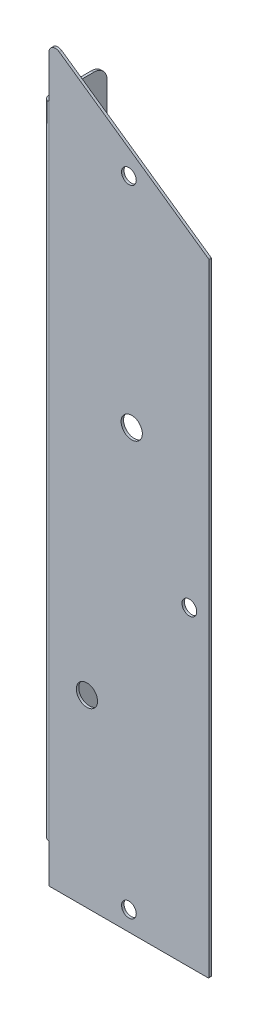
ISO-10303-21;
HEADER;
FILE_DESCRIPTION(('STEP AP214'),'2;1');
FILE_NAME('part.step','',(''),(''),'','','');
FILE_SCHEMA(('AUTOMOTIVE_DESIGN { 1 0 10303 214 1 1 1 1 }'));
ENDSEC;
DATA;
#1=APPLICATION_CONTEXT('core data for automotive mechanical design processes');
#2=APPLICATION_PROTOCOL_DEFINITION('international standard','automotive_design',2000,#1);
#3=PRODUCT_CONTEXT('',#1,'mechanical');
#4=PRODUCT('Part','Part','',(#3));
#5=PRODUCT_RELATED_PRODUCT_CATEGORY('part','',(#4));
#6=PRODUCT_DEFINITION_FORMATION('','',#4);
#7=PRODUCT_DEFINITION_CONTEXT('part definition',#1,'design');
#8=PRODUCT_DEFINITION('design','',#6,#7);
#9=PRODUCT_DEFINITION_SHAPE('','',#8);
#10=(LENGTH_UNIT() NAMED_UNIT(*) SI_UNIT(.MILLI.,.METRE.));
#11=(NAMED_UNIT(*) PLANE_ANGLE_UNIT() SI_UNIT($,.RADIAN.));
#12=(NAMED_UNIT(*) SI_UNIT($,.STERADIAN.) SOLID_ANGLE_UNIT());
#13=UNCERTAINTY_MEASURE_WITH_UNIT(LENGTH_MEASURE(1.E-05),#10,'distance_accuracy_value','');
#14=(GEOMETRIC_REPRESENTATION_CONTEXT(3) GLOBAL_UNCERTAINTY_ASSIGNED_CONTEXT((#13)) GLOBAL_UNIT_ASSIGNED_CONTEXT((#10,
#11,#12)) REPRESENTATION_CONTEXT('',''));
#15=CARTESIAN_POINT('',(0.,0.,0.));
#16=DIRECTION('',(0.,0.,1.));
#17=DIRECTION('',(1.,0.,0.));
#18=AXIS2_PLACEMENT_3D('',#15,#16,#17);
#19=CARTESIAN_POINT('',(-38.89375,-151.360053060756,-1.1938));
#20=DIRECTION('',(-1.,0.,0.));
#21=DIRECTION('',(0.,0.,1.));
#22=AXIS2_PLACEMENT_3D('',#19,#20,#21);
#23=PLANE('',#22);
#24=DIRECTION('',(0.,-1.,0.));
#25=VECTOR('',#24,1.);
#26=CARTESIAN_POINT('',(-38.89375,151.360053060756,-1.1938));
#27=LINE('',#26,#25);
#28=CARTESIAN_POINT('',(-38.89375,199.72832868611,-1.1938));
#29=VERTEX_POINT('',#28);
#30=CARTESIAN_POINT('',(-38.89375,179.236821939244,-1.1938));
#31=VERTEX_POINT('',#30);
#32=EDGE_CURVE('E232',#29,#31,#27,.T.);
#33=ORIENTED_EDGE('',*,*,#32,.T.);
#34=DIRECTION('',(0.,0.,-1.));
#35=VECTOR('',#34,1.);
#36=CARTESIAN_POINT('',(-38.89375,179.236821939244,0.));
#37=LINE('',#36,#35);
#38=CARTESIAN_POINT('',(-38.89375,179.236821939244,0.));
#39=VERTEX_POINT('',#38);
#40=EDGE_CURVE('E328',#31,#39,#37,.F.);
#41=ORIENTED_EDGE('',*,*,#40,.T.);
#42=DIRECTION('',(0.,-1.,0.));
#43=VECTOR('',#42,1.);
#44=CARTESIAN_POINT('',(-38.89375,-151.360053060756,0.));
#45=LINE('',#44,#43);
#46=CARTESIAN_POINT('',(-38.89375,199.72832868611,0.));
#47=VERTEX_POINT('',#46);
#48=EDGE_CURVE('E245',#47,#39,#45,.T.);
#49=ORIENTED_EDGE('',*,*,#48,.F.);
#50=DIRECTION('',(0.,0.,1.));
#51=VECTOR('',#50,1.);
#52=CARTESIAN_POINT('',(-38.89375,199.72832868611,-1.1938));
#53=LINE('',#52,#51);
#54=EDGE_CURVE('E261',#47,#29,#53,.F.);
#55=ORIENTED_EDGE('',*,*,#54,.T.);
#56=EDGE_LOOP('',(#33,#41,#49,#55));
#57=FACE_BOUND('',#56,.T.);
#58=ADVANCED_FACE('F47',(#57),#23,.T.);
#59=CARTESIAN_POINT('',(-38.89375,205.827446939244,-1.1938));
#60=DIRECTION('',(0.573576436351047,0.819152044288991,0.));
#61=DIRECTION('',(-0.819152044288991,0.573576436351047,0.));
#62=AXIS2_PLACEMENT_3D('',#59,#60,#61);
#63=PLANE('',#62);
#64=DIRECTION('',(-0.819152044288991,0.573576436351047,0.));
#65=VECTOR('',#64,1.);
#66=CARTESIAN_POINT('',(-38.89375,205.827446939244,0.));
#67=LINE('',#66,#65);
#68=CARTESIAN_POINT('',(38.7245131481768,151.478553980145,0.));
#69=VERTEX_POINT('',#68);
#70=CARTESIAN_POINT('',(-33.8976448145854,202.329136426728,0.));
#71=VERTEX_POINT('',#70);
#72=EDGE_CURVE('E214',#69,#71,#67,.T.);
#73=ORIENTED_EDGE('',*,*,#72,.F.);
#74=DIRECTION('',(0.,0.,1.));
#75=VECTOR('',#74,1.);
#76=CARTESIAN_POINT('',(38.7245131481768,151.478553980145,-1.1938));
#77=LINE('',#76,#75);
#78=CARTESIAN_POINT('',(38.7245131481768,151.478553980145,-1.1938));
#79=VERTEX_POINT('',#78);
#80=EDGE_CURVE('E325',#69,#79,#77,.F.);
#81=ORIENTED_EDGE('',*,*,#80,.T.);
#82=DIRECTION('',(-0.819152044288991,0.573576436351047,0.));
#83=VECTOR('',#82,1.);
#84=CARTESIAN_POINT('',(-38.89375,205.827446939244,-1.1938));
#85=LINE('',#84,#83);
#86=CARTESIAN_POINT('',(-33.8976448145854,202.329136426728,-1.1938));
#87=VERTEX_POINT('',#86);
#88=EDGE_CURVE('E227',#79,#87,#85,.T.);
#89=ORIENTED_EDGE('',*,*,#88,.T.);
#90=DIRECTION('',(0.,0.,1.));
#91=VECTOR('',#90,1.);
#92=CARTESIAN_POINT('',(-33.8976448145854,202.329136426728,-1.1938));
#93=LINE('',#92,#91);
#94=EDGE_CURVE('E243',#87,#71,#93,.T.);
#95=ORIENTED_EDGE('',*,*,#94,.T.);
#96=EDGE_LOOP('',(#73,#81,#89,#95));
#97=FACE_BOUND('',#96,.T.);
#98=ADVANCED_FACE('F391',(#97),#63,.T.);
#99=CARTESIAN_POINT('',(38.89375,-151.360053060756,-1.1938));
#100=DIRECTION('',(1.,0.,0.));
#101=DIRECTION('',(0.,0.,-1.));
#102=AXIS2_PLACEMENT_3D('',#99,#100,#101);
#103=PLANE('',#102);
#104=DIRECTION('',(0.,1.,0.));
#105=VECTOR('',#104,1.);
#106=CARTESIAN_POINT('',(38.89375,-151.360053060756,0.));
#107=LINE('',#106,#105);
#108=CARTESIAN_POINT('',(38.89375,-150.963178060756,0.));
#109=VERTEX_POINT('',#108);
#110=CARTESIAN_POINT('',(38.89375,151.153453012568,0.));
#111=VERTEX_POINT('',#110);
#112=EDGE_CURVE('E231',#109,#111,#107,.T.);
#113=ORIENTED_EDGE('',*,*,#112,.F.);
#114=DIRECTION('',(0.,0.,1.));
#115=VECTOR('',#114,1.);
#116=CARTESIAN_POINT('',(38.89375,-150.963178060756,-1.1938));
#117=LINE('',#116,#115);
#118=CARTESIAN_POINT('',(38.89375,-150.963178060756,-1.1938));
#119=VERTEX_POINT('',#118);
#120=EDGE_CURVE('E313',#109,#119,#117,.F.);
#121=ORIENTED_EDGE('',*,*,#120,.T.);
#122=DIRECTION('',(0.,1.,0.));
#123=VECTOR('',#122,1.);
#124=CARTESIAN_POINT('',(38.89375,-151.360053060756,-1.1938));
#125=LINE('',#124,#123);
#126=CARTESIAN_POINT('',(38.89375,151.153453012568,-1.1938));
#127=VERTEX_POINT('',#126);
#128=EDGE_CURVE('E240',#119,#127,#125,.T.);
#129=ORIENTED_EDGE('',*,*,#128,.T.);
#130=DIRECTION('',(0.,0.,1.));
#131=VECTOR('',#130,1.);
#132=CARTESIAN_POINT('',(38.89375,151.153453012568,-1.1938));
#133=LINE('',#132,#131);
#134=EDGE_CURVE('E309',#127,#111,#133,.T.);
#135=ORIENTED_EDGE('',*,*,#134,.T.);
#136=EDGE_LOOP('',(#113,#121,#129,#135));
#137=FACE_BOUND('',#136,.T.);
#138=ADVANCED_FACE('F399',(#137),#103,.T.);
#139=CARTESIAN_POINT('',(-38.89375,-151.360053060756,-1.1938));
#140=DIRECTION('',(0.,-1.,0.));
#141=DIRECTION('',(0.,0.,-1.));
#142=AXIS2_PLACEMENT_3D('',#139,#140,#141);
#143=PLANE('',#142);
#144=DIRECTION('',(1.,0.,0.));
#145=VECTOR('',#144,1.);
#146=CARTESIAN_POINT('',(-38.89375,-151.360053060756,-1.1938));
#147=LINE('',#146,#145);
#148=CARTESIAN_POINT('',(-38.496875,-151.360053060756,-1.1938));
#149=VERTEX_POINT('',#148);
#150=CARTESIAN_POINT('',(38.496875,-151.360053060756,-1.1938));
#151=VERTEX_POINT('',#150);
#152=EDGE_CURVE('E236',#149,#151,#147,.T.);
#153=ORIENTED_EDGE('',*,*,#152,.T.);
#154=DIRECTION('',(0.,0.,1.));
#155=VECTOR('',#154,1.);
#156=CARTESIAN_POINT('',(38.496875,-151.360053060756,-1.1938));
#157=LINE('',#156,#155);
#158=CARTESIAN_POINT('',(38.496875,-151.360053060756,0.));
#159=VERTEX_POINT('',#158);
#160=EDGE_CURVE('E296',#151,#159,#157,.T.);
#161=ORIENTED_EDGE('',*,*,#160,.T.);
#162=DIRECTION('',(1.,0.,0.));
#163=VECTOR('',#162,1.);
#164=CARTESIAN_POINT('',(-38.89375,-151.360053060756,0.));
#165=LINE('',#164,#163);
#166=CARTESIAN_POINT('',(-38.496875,-151.360053060756,0.));
#167=VERTEX_POINT('',#166);
#168=EDGE_CURVE('E248',#167,#159,#165,.T.);
#169=ORIENTED_EDGE('',*,*,#168,.F.);
#170=DIRECTION('',(0.,0.,1.));
#171=VECTOR('',#170,1.);
#172=CARTESIAN_POINT('',(-38.496875,-151.360053060756,-1.1938));
#173=LINE('',#172,#171);
#174=EDGE_CURVE('E293',#167,#149,#173,.F.);
#175=ORIENTED_EDGE('',*,*,#174,.T.);
#176=EDGE_LOOP('',(#153,#161,#169,#175));
#177=FACE_BOUND('',#176,.T.);
#178=ADVANCED_FACE('F404',(#177),#143,.T.);
#179=CARTESIAN_POINT('',(-38.89375,-132.706928060756,0.));
#180=VERTEX_POINT('',#179);
#181=CARTESIAN_POINT('',(-38.89375,-150.963178060756,0.));
#182=VERTEX_POINT('',#181);
#183=EDGE_CURVE('E220',#180,#182,#45,.T.);
#184=ORIENTED_EDGE('',*,*,#183,.F.);
#185=DIRECTION('',(0.,0.,-1.));
#186=VECTOR('',#185,1.);
#187=CARTESIAN_POINT('',(-38.89375,-132.706928060756,-1.1938));
#188=LINE('',#187,#186);
#189=CARTESIAN_POINT('',(-38.89375,-132.706928060756,-1.1938));
#190=VERTEX_POINT('',#189);
#191=EDGE_CURVE('E341',#180,#190,#188,.T.);
#192=ORIENTED_EDGE('',*,*,#191,.T.);
#193=CARTESIAN_POINT('',(-38.89375,-150.963178060756,-1.1938));
#194=VERTEX_POINT('',#193);
#195=EDGE_CURVE('E230',#190,#194,#27,.T.);
#196=ORIENTED_EDGE('',*,*,#195,.T.);
#197=DIRECTION('',(0.,0.,1.));
#198=VECTOR('',#197,1.);
#199=CARTESIAN_POINT('',(-38.89375,-150.963178060756,-1.1938));
#200=LINE('',#199,#198);
#201=EDGE_CURVE('E337',#194,#182,#200,.T.);
#202=ORIENTED_EDGE('',*,*,#201,.T.);
#203=EDGE_LOOP('',(#184,#192,#196,#202));
#204=FACE_BOUND('',#203,.T.);
#205=ADVANCED_FACE('F394',(#204),#23,.T.);
#206=CARTESIAN_POINT('',(0.,0.,-1.1938));
#207=DIRECTION('',(0.,0.,1.));
#208=DIRECTION('',(1.,0.,0.));
#209=AXIS2_PLACEMENT_3D('',#206,#207,#208);
#210=PLANE('',#209);
#211=CARTESIAN_POINT('',(1.36382604082695,61.7536011623218,-1.1938));
#212=DIRECTION('',(0.,0.,1.));
#213=DIRECTION('',(1.,0.,0.));
#214=AXIS2_PLACEMENT_3D('',#211,#212,#213);
#215=CIRCLE('',#214,5.159375);
#216=CARTESIAN_POINT('',(6.52320104082695,61.7536011623218,-1.1938));
#217=VERTEX_POINT('',#216);
#218=EDGE_CURVE('E822',#217,#217,#215,.T.);
#219=ORIENTED_EDGE('',*,*,#218,.T.);
#220=EDGE_LOOP('',(#219));
#221=FACE_BOUND('',#220,.T.);
#222=CARTESIAN_POINT('',(-20.413826040827,-61.7536011623218,-1.1938));
#223=DIRECTION('',(0.,0.,1.));
#224=DIRECTION('',(1.,0.,0.));
#225=AXIS2_PLACEMENT_3D('',#222,#223,#224);
#226=CIRCLE('',#225,5.159375);
#227=CARTESIAN_POINT('',(-15.254451040827,-61.7536011623218,-1.1938));
#228=VERTEX_POINT('',#227);
#229=EDGE_CURVE('E830',#228,#228,#226,.T.);
#230=ORIENTED_EDGE('',*,*,#229,.T.);
#231=EDGE_LOOP('',(#230));
#232=FACE_BOUND('',#231,.T.);
#233=CARTESIAN_POINT('',(29.36875,0.,-1.1938));
#234=DIRECTION('',(0.,0.,1.));
#235=DIRECTION('',(1.,0.,0.));
#236=AXIS2_PLACEMENT_3D('',#233,#234,#235);
#237=CIRCLE('',#236,3.571875);
#238=CARTESIAN_POINT('',(32.940625,0.,-1.1938));
#239=VERTEX_POINT('',#238);
#240=EDGE_CURVE('E434',#239,#239,#237,.F.);
#241=ORIENTED_EDGE('',*,*,#240,.F.);
#242=EDGE_LOOP('',(#241));
#243=FACE_BOUND('',#242,.T.);
#244=CARTESIAN_POINT('',(0.,-141.835053060756,-1.1938));
#245=DIRECTION('',(0.,0.,1.));
#246=DIRECTION('',(1.,0.,0.));
#247=AXIS2_PLACEMENT_3D('',#244,#245,#246);
#248=CIRCLE('',#247,3.57187500000001);
#249=CARTESIAN_POINT('',(3.57187500000001,-141.835053060756,-1.1938));
#250=VERTEX_POINT('',#249);
#251=EDGE_CURVE('E833',#250,#250,#248,.F.);
#252=ORIENTED_EDGE('',*,*,#251,.F.);
#253=EDGE_LOOP('',(#252));
#254=FACE_BOUND('',#253,.T.);
#255=CARTESIAN_POINT('',(0.,166.965872042047,-1.1938));
#256=DIRECTION('',(0.,0.,1.));
#257=DIRECTION('',(1.,0.,0.));
#258=AXIS2_PLACEMENT_3D('',#255,#256,#257);
#259=CIRCLE('',#258,3.57187500000001);
#260=CARTESIAN_POINT('',(3.57187500000001,166.965872042047,-1.1938));
#261=VERTEX_POINT('',#260);
#262=EDGE_CURVE('E821',#261,#261,#259,.F.);
#263=ORIENTED_EDGE('',*,*,#262,.F.);
#264=EDGE_LOOP('',(#263));
#265=FACE_BOUND('',#264,.T.);
#266=ORIENTED_EDGE('',*,*,#128,.F.);
#267=CARTESIAN_POINT('',(38.496875,-150.963178060756,-1.1938));
#268=DIRECTION('',(0.,0.,1.));
#269=DIRECTION('',(1.,0.,0.));
#270=AXIS2_PLACEMENT_3D('',#267,#268,#269);
#271=CIRCLE('',#270,0.396875);
#272=EDGE_CURVE('E322',#119,#151,#271,.F.);
#273=ORIENTED_EDGE('',*,*,#272,.T.);
#274=ORIENTED_EDGE('',*,*,#152,.F.);
#275=CARTESIAN_POINT('',(-38.496875,-150.963178060756,-1.1938));
#276=DIRECTION('',(0.,0.,1.));
#277=DIRECTION('',(1.,0.,0.));
#278=AXIS2_PLACEMENT_3D('',#275,#276,#277);
#279=CIRCLE('',#278,0.396875);
#280=EDGE_CURVE('E316',#149,#194,#279,.F.);
#281=ORIENTED_EDGE('',*,*,#280,.T.);
#282=ORIENTED_EDGE('',*,*,#195,.F.);
#283=DIRECTION('',(0.,1.,0.));
#284=VECTOR('',#283,1.);
#285=CARTESIAN_POINT('',(-38.89375,-1937.29755306076,-1.1938));
#286=LINE('',#285,#284);
#287=EDGE_CURVE('E426',#190,#31,#286,.T.);
#288=ORIENTED_EDGE('',*,*,#287,.T.);
#289=ORIENTED_EDGE('',*,*,#32,.F.);
#290=CARTESIAN_POINT('',(-35.71875,199.72832868611,-1.1938));
#291=DIRECTION('',(0.,0.,1.));
#292=DIRECTION('',(1.,0.,0.));
#293=AXIS2_PLACEMENT_3D('',#290,#291,#292);
#294=CIRCLE('',#293,3.175);
#295=EDGE_CURVE('E264',#29,#87,#294,.F.);
#296=ORIENTED_EDGE('',*,*,#295,.T.);
#297=ORIENTED_EDGE('',*,*,#88,.F.);
#298=CARTESIAN_POINT('',(38.496875,151.153453012568,-1.1938));
#299=DIRECTION('',(0.,0.,1.));
#300=DIRECTION('',(1.,0.,0.));
#301=AXIS2_PLACEMENT_3D('',#298,#299,#300);
#302=CIRCLE('',#301,0.396875);
#303=EDGE_CURVE('E319',#79,#127,#302,.F.);
#304=ORIENTED_EDGE('',*,*,#303,.T.);
#305=EDGE_LOOP('',(#266,#273,#274,#281,#282,#288,#289,#296,#297,#304));
#306=FACE_BOUND('',#305,.T.);
#307=ADVANCED_FACE('F403',(#221,#232,#243,#254,#265,#306),#210,.F.);
#308=CARTESIAN_POINT('',(0.,0.,0.));
#309=DIRECTION('',(0.,0.,1.));
#310=DIRECTION('',(1.,0.,0.));
#311=AXIS2_PLACEMENT_3D('',#308,#309,#310);
#312=PLANE('',#311);
#313=CARTESIAN_POINT('',(1.36382604082695,61.7536011623218,0.));
#314=DIRECTION('',(0.,0.,1.));
#315=DIRECTION('',(1.,0.,0.));
#316=AXIS2_PLACEMENT_3D('',#313,#314,#315);
#317=CIRCLE('',#316,5.159375);
#318=CARTESIAN_POINT('',(6.52320104082695,61.7536011623218,0.));
#319=VERTEX_POINT('',#318);
#320=EDGE_CURVE('E804',#319,#319,#317,.T.);
#321=ORIENTED_EDGE('',*,*,#320,.F.);
#322=EDGE_LOOP('',(#321));
#323=FACE_BOUND('',#322,.T.);
#324=CARTESIAN_POINT('',(-20.413826040827,-61.7536011623218,0.));
#325=DIRECTION('',(0.,0.,1.));
#326=DIRECTION('',(1.,0.,0.));
#327=AXIS2_PLACEMENT_3D('',#324,#325,#326);
#328=CIRCLE('',#327,5.159375);
#329=CARTESIAN_POINT('',(-15.254451040827,-61.7536011623218,0.));
#330=VERTEX_POINT('',#329);
#331=EDGE_CURVE('E808',#330,#330,#328,.T.);
#332=ORIENTED_EDGE('',*,*,#331,.F.);
#333=EDGE_LOOP('',(#332));
#334=FACE_BOUND('',#333,.T.);
#335=CARTESIAN_POINT('',(29.36875,0.,0.));
#336=DIRECTION('',(0.,0.,1.));
#337=DIRECTION('',(1.,0.,0.));
#338=AXIS2_PLACEMENT_3D('',#335,#336,#337);
#339=CIRCLE('',#338,3.571875);
#340=CARTESIAN_POINT('',(32.940625,0.,0.));
#341=VERTEX_POINT('',#340);
#342=EDGE_CURVE('E812',#341,#341,#339,.T.);
#343=ORIENTED_EDGE('',*,*,#342,.F.);
#344=EDGE_LOOP('',(#343));
#345=FACE_BOUND('',#344,.T.);
#346=CARTESIAN_POINT('',(0.,-141.835053060756,0.));
#347=DIRECTION('',(0.,0.,1.));
#348=DIRECTION('',(1.,0.,0.));
#349=AXIS2_PLACEMENT_3D('',#346,#347,#348);
#350=CIRCLE('',#349,3.57187500000001);
#351=CARTESIAN_POINT('',(3.57187500000001,-141.835053060756,0.));
#352=VERTEX_POINT('',#351);
#353=EDGE_CURVE('E816',#352,#352,#350,.T.);
#354=ORIENTED_EDGE('',*,*,#353,.F.);
#355=EDGE_LOOP('',(#354));
#356=FACE_BOUND('',#355,.T.);
#357=CARTESIAN_POINT('',(0.,166.965872042047,0.));
#358=DIRECTION('',(0.,0.,1.));
#359=DIRECTION('',(1.,0.,0.));
#360=AXIS2_PLACEMENT_3D('',#357,#358,#359);
#361=CIRCLE('',#360,3.57187500000001);
#362=CARTESIAN_POINT('',(3.57187500000001,166.965872042047,0.));
#363=VERTEX_POINT('',#362);
#364=EDGE_CURVE('E819',#363,#363,#361,.T.);
#365=ORIENTED_EDGE('',*,*,#364,.F.);
#366=EDGE_LOOP('',(#365));
#367=FACE_BOUND('',#366,.T.);
#368=ORIENTED_EDGE('',*,*,#168,.T.);
#369=CARTESIAN_POINT('',(38.496875,-150.963178060756,0.));
#370=DIRECTION('',(0.,0.,1.));
#371=DIRECTION('',(1.,0.,0.));
#372=AXIS2_PLACEMENT_3D('',#369,#370,#371);
#373=CIRCLE('',#372,0.396875);
#374=EDGE_CURVE('E306',#159,#109,#373,.T.);
#375=ORIENTED_EDGE('',*,*,#374,.T.);
#376=ORIENTED_EDGE('',*,*,#112,.T.);
#377=CARTESIAN_POINT('',(38.496875,151.153453012568,0.));
#378=DIRECTION('',(0.,0.,1.));
#379=DIRECTION('',(1.,0.,0.));
#380=AXIS2_PLACEMENT_3D('',#377,#378,#379);
#381=CIRCLE('',#380,0.396875);
#382=EDGE_CURVE('E303',#111,#69,#381,.T.);
#383=ORIENTED_EDGE('',*,*,#382,.T.);
#384=ORIENTED_EDGE('',*,*,#72,.T.);
#385=CARTESIAN_POINT('',(-35.71875,199.72832868611,0.));
#386=DIRECTION('',(0.,0.,1.));
#387=DIRECTION('',(1.,0.,0.));
#388=AXIS2_PLACEMENT_3D('',#385,#386,#387);
#389=CIRCLE('',#388,3.175);
#390=EDGE_CURVE('E258',#71,#47,#389,.T.);
#391=ORIENTED_EDGE('',*,*,#390,.T.);
#392=ORIENTED_EDGE('',*,*,#48,.T.);
#393=DIRECTION('',(0.,1.,0.));
#394=VECTOR('',#393,1.);
#395=CARTESIAN_POINT('',(-38.89375,-1937.29755306076,0.));
#396=LINE('',#395,#394);
#397=EDGE_CURVE('E69',#180,#39,#396,.T.);
#398=ORIENTED_EDGE('',*,*,#397,.F.);
#399=ORIENTED_EDGE('',*,*,#183,.T.);
#400=CARTESIAN_POINT('',(-38.496875,-150.963178060756,0.));
#401=DIRECTION('',(0.,0.,1.));
#402=DIRECTION('',(1.,0.,0.));
#403=AXIS2_PLACEMENT_3D('',#400,#401,#402);
#404=CIRCLE('',#403,0.396875);
#405=EDGE_CURVE('E300',#182,#167,#404,.T.);
#406=ORIENTED_EDGE('',*,*,#405,.T.);
#407=EDGE_LOOP('',(#368,#375,#376,#383,#384,#391,#392,#398,#399,#406));
#408=FACE_BOUND('',#407,.T.);
#409=ADVANCED_FACE('F409',(#323,#334,#345,#356,#367,#408),#312,.T.);
#410=CARTESIAN_POINT('',(-40.39235,-151.360053060756,-29.7688));
#411=DIRECTION('',(0.,0.,1.));
#412=DIRECTION('',(0.,1.,0.));
#413=AXIS2_PLACEMENT_3D('',#410,#411,#412);
#414=PLANE('',#413);
#415=DIRECTION('',(0.,1.,0.));
#416=VECTOR('',#415,1.);
#417=CARTESIAN_POINT('',(-40.39235,-151.360053060756,-29.7688));
#418=LINE('',#417,#416);
#419=CARTESIAN_POINT('',(-40.39235,-125.960053060756,-29.7688));
#420=VERTEX_POINT('',#419);
#421=CARTESIAN_POINT('',(-40.39235,172.489946939244,-29.7688));
#422=VERTEX_POINT('',#421);
#423=EDGE_CURVE('E443',#420,#422,#418,.T.);
#424=ORIENTED_EDGE('',*,*,#423,.F.);
#425=DIRECTION('',(-1.,0.,0.));
#426=VECTOR('',#425,1.);
#427=CARTESIAN_POINT('',(-40.39235,-125.960053060756,-29.7688));
#428=LINE('',#427,#426);
#429=CARTESIAN_POINT('',(-41.58615,-125.960053060756,-29.7688));
#430=VERTEX_POINT('',#429);
#431=EDGE_CURVE('E271',#420,#430,#428,.T.);
#432=ORIENTED_EDGE('',*,*,#431,.T.);
#433=DIRECTION('',(0.,1.,0.));
#434=VECTOR('',#433,1.);
#435=CARTESIAN_POINT('',(-41.58615,-151.360053060756,-29.7688));
#436=LINE('',#435,#434);
#437=CARTESIAN_POINT('',(-41.58615,172.489946939244,-29.7688));
#438=VERTEX_POINT('',#437);
#439=EDGE_CURVE('E197',#430,#438,#436,.T.);
#440=ORIENTED_EDGE('',*,*,#439,.T.);
#441=DIRECTION('',(-1.,0.,0.));
#442=VECTOR('',#441,1.);
#443=CARTESIAN_POINT('',(-40.39235,172.489946939244,-29.7688));
#444=LINE('',#443,#442);
#445=EDGE_CURVE('E268',#438,#422,#444,.F.);
#446=ORIENTED_EDGE('',*,*,#445,.T.);
#447=EDGE_LOOP('',(#424,#432,#440,#446));
#448=FACE_BOUND('',#447,.T.);
#449=ADVANCED_FACE('F466',(#448),#414,.F.);
#450=CARTESIAN_POINT('',(-40.39235,-132.310053060756,-29.7688));
#451=DIRECTION('',(0.,-1.,0.));
#452=DIRECTION('',(0.,0.,1.));
#453=AXIS2_PLACEMENT_3D('',#450,#451,#452);
#454=PLANE('',#453);
#455=DIRECTION('',(0.,0.,1.));
#456=VECTOR('',#455,1.);
#457=CARTESIAN_POINT('',(-41.58615,-132.310053060756,-29.7688));
#458=LINE('',#457,#456);
#459=CARTESIAN_POINT('',(-41.58615,-132.310053060756,-23.4188));
#460=VERTEX_POINT('',#459);
#461=CARTESIAN_POINT('',(-41.58615,-132.310053060756,-2.6924));
#462=VERTEX_POINT('',#461);
#463=EDGE_CURVE('E173',#460,#462,#458,.T.);
#464=ORIENTED_EDGE('',*,*,#463,.F.);
#465=DIRECTION('',(1.,0.,0.));
#466=VECTOR('',#465,1.);
#467=CARTESIAN_POINT('',(-40.39235,-132.310053060756,-23.4188));
#468=LINE('',#467,#466);
#469=CARTESIAN_POINT('',(-40.39235,-132.310053060756,-23.4188));
#470=VERTEX_POINT('',#469);
#471=EDGE_CURVE('E280',#460,#470,#468,.T.);
#472=ORIENTED_EDGE('',*,*,#471,.T.);
#473=DIRECTION('',(0.,0.,1.));
#474=VECTOR('',#473,1.);
#475=CARTESIAN_POINT('',(-40.39235,-132.310053060756,-29.7688));
#476=LINE('',#475,#474);
#477=CARTESIAN_POINT('',(-40.39235,-132.310053060756,-2.6924));
#478=VERTEX_POINT('',#477);
#479=EDGE_CURVE('E212',#470,#478,#476,.T.);
#480=ORIENTED_EDGE('',*,*,#479,.T.);
#481=DIRECTION('',(-1.,0.,0.));
#482=VECTOR('',#481,1.);
#483=CARTESIAN_POINT('',(-40.39235,-132.310053060756,-2.6924));
#484=LINE('',#483,#482);
#485=EDGE_CURVE('E204',#478,#462,#484,.T.);
#486=ORIENTED_EDGE('',*,*,#485,.T.);
#487=EDGE_LOOP('',(#464,#472,#480,#486));
#488=FACE_BOUND('',#487,.T.);
#489=ADVANCED_FACE('F210',(#488),#454,.T.);
#490=CARTESIAN_POINT('',(-40.39235,178.839946939244,-29.7688));
#491=DIRECTION('',(0.,1.,0.));
#492=DIRECTION('',(0.,0.,-1.));
#493=AXIS2_PLACEMENT_3D('',#490,#491,#492);
#494=PLANE('',#493);
#495=DIRECTION('',(0.,0.,-1.));
#496=VECTOR('',#495,1.);
#497=CARTESIAN_POINT('',(-40.39235,178.839946939244,-29.7688));
#498=LINE('',#497,#496);
#499=CARTESIAN_POINT('',(-40.39235,178.839946939244,-2.6924));
#500=VERTEX_POINT('',#499);
#501=CARTESIAN_POINT('',(-40.39235,178.839946939244,-23.4188));
#502=VERTEX_POINT('',#501);
#503=EDGE_CURVE('E224',#500,#502,#498,.T.);
#504=ORIENTED_EDGE('',*,*,#503,.T.);
#505=DIRECTION('',(1.,0.,0.));
#506=VECTOR('',#505,1.);
#507=CARTESIAN_POINT('',(-40.39235,178.839946939244,-23.4188));
#508=LINE('',#507,#506);
#509=CARTESIAN_POINT('',(-41.58615,178.839946939244,-23.4188));
#510=VERTEX_POINT('',#509);
#511=EDGE_CURVE('E289',#502,#510,#508,.F.);
#512=ORIENTED_EDGE('',*,*,#511,.T.);
#513=DIRECTION('',(0.,0.,1.));
#514=VECTOR('',#513,1.);
#515=CARTESIAN_POINT('',(-41.58615,178.839946939244,-29.7688));
#516=LINE('',#515,#514);
#517=CARTESIAN_POINT('',(-41.58615,178.839946939244,-2.6924));
#518=VERTEX_POINT('',#517);
#519=EDGE_CURVE('E185',#518,#510,#516,.F.);
#520=ORIENTED_EDGE('',*,*,#519,.F.);
#521=DIRECTION('',(-1.,0.,0.));
#522=VECTOR('',#521,1.);
#523=CARTESIAN_POINT('',(-40.39235,178.839946939244,-2.6924));
#524=LINE('',#523,#522);
#525=EDGE_CURVE('E215',#500,#518,#524,.T.);
#526=ORIENTED_EDGE('',*,*,#525,.F.);
#527=EDGE_LOOP('',(#504,#512,#520,#526));
#528=FACE_BOUND('',#527,.T.);
#529=ADVANCED_FACE('F458',(#528),#494,.T.);
#530=CARTESIAN_POINT('',(-41.58615,-151.360053060756,-29.7688));
#531=DIRECTION('',(-1.,0.,0.));
#532=DIRECTION('',(0.,0.,1.));
#533=AXIS2_PLACEMENT_3D('',#530,#531,#532);
#534=PLANE('',#533);
#535=ORIENTED_EDGE('',*,*,#439,.F.);
#536=CARTESIAN_POINT('',(-41.58615,-125.960053060756,-23.4188));
#537=DIRECTION('',(-1.,0.,0.));
#538=DIRECTION('',(0.,0.,1.));
#539=AXIS2_PLACEMENT_3D('',#536,#537,#538);
#540=CIRCLE('',#539,6.35);
#541=EDGE_CURVE('E180',#430,#460,#540,.T.);
#542=ORIENTED_EDGE('',*,*,#541,.T.);
#543=ORIENTED_EDGE('',*,*,#463,.T.);
#544=DIRECTION('',(0.,1.,0.));
#545=VECTOR('',#544,1.);
#546=CARTESIAN_POINT('',(-41.58615,-151.360053060756,-2.6924));
#547=LINE('',#546,#545);
#548=EDGE_CURVE('E178',#462,#518,#547,.T.);
#549=ORIENTED_EDGE('',*,*,#548,.T.);
#550=ORIENTED_EDGE('',*,*,#519,.T.);
#551=CARTESIAN_POINT('',(-41.58615,172.489946939244,-23.4188));
#552=DIRECTION('',(-1.,0.,0.));
#553=DIRECTION('',(0.,0.,1.));
#554=AXIS2_PLACEMENT_3D('',#551,#552,#553);
#555=CIRCLE('',#554,6.35);
#556=EDGE_CURVE('E275',#510,#438,#555,.T.);
#557=ORIENTED_EDGE('',*,*,#556,.T.);
#558=EDGE_LOOP('',(#535,#542,#543,#549,#550,#557));
#559=FACE_BOUND('',#558,.T.);
#560=ADVANCED_FACE('F176',(#559),#534,.T.);
#561=CARTESIAN_POINT('',(-40.39235,-151.360053060756,-29.7688));
#562=DIRECTION('',(-1.,0.,0.));
#563=DIRECTION('',(0.,0.,1.));
#564=AXIS2_PLACEMENT_3D('',#561,#562,#563);
#565=PLANE('',#564);
#566=ORIENTED_EDGE('',*,*,#479,.F.);
#567=CARTESIAN_POINT('',(-40.39235,-125.960053060756,-23.4188));
#568=DIRECTION('',(-1.,0.,0.));
#569=DIRECTION('',(0.,0.,1.));
#570=AXIS2_PLACEMENT_3D('',#567,#568,#569);
#571=CIRCLE('',#570,6.35);
#572=EDGE_CURVE('E286',#470,#420,#571,.F.);
#573=ORIENTED_EDGE('',*,*,#572,.T.);
#574=ORIENTED_EDGE('',*,*,#423,.T.);
#575=CARTESIAN_POINT('',(-40.39235,172.489946939244,-23.4188));
#576=DIRECTION('',(-1.,0.,0.));
#577=DIRECTION('',(0.,0.,1.));
#578=AXIS2_PLACEMENT_3D('',#575,#576,#577);
#579=CIRCLE('',#578,6.35);
#580=EDGE_CURVE('E283',#422,#502,#579,.F.);
#581=ORIENTED_EDGE('',*,*,#580,.T.);
#582=ORIENTED_EDGE('',*,*,#503,.F.);
#583=DIRECTION('',(0.,1.,0.));
#584=VECTOR('',#583,1.);
#585=CARTESIAN_POINT('',(-40.39235,-151.360053060756,-2.6924));
#586=LINE('',#585,#584);
#587=EDGE_CURVE('E447',#478,#500,#586,.T.);
#588=ORIENTED_EDGE('',*,*,#587,.F.);
#589=EDGE_LOOP('',(#566,#573,#574,#581,#582,#588));
#590=FACE_BOUND('',#589,.T.);
#591=ADVANCED_FACE('F471',(#590),#565,.F.);
#592=CARTESIAN_POINT('',(-38.89375,-132.310053060756,-2.6924));
#593=DIRECTION('',(0.,1.,0.));
#594=DIRECTION('',(0.,0.,1.));
#595=AXIS2_PLACEMENT_3D('',#592,#593,#594);
#596=PLANE('',#595);
#597=CARTESIAN_POINT('',(-38.89375,-132.310053060756,-2.6924));
#598=DIRECTION('',(0.,-1.,0.));
#599=DIRECTION('',(0.,0.,-1.));
#600=AXIS2_PLACEMENT_3D('',#597,#598,#599);
#601=CIRCLE('',#600,1.4986);
#602=CARTESIAN_POINT('',(-39.290625,-132.310053060756,-1.24730754815652));
#603=VERTEX_POINT('',#602);
#604=EDGE_CURVE('E423',#478,#603,#601,.F.);
#605=ORIENTED_EDGE('',*,*,#604,.T.);
#606=DIRECTION('',(0.,0.,1.));
#607=VECTOR('',#606,1.);
#608=CARTESIAN_POINT('',(-39.290625,-132.310053060756,0.));
#609=LINE('',#608,#607);
#610=CARTESIAN_POINT('',(-39.290625,-132.310053060756,-0.0294114543289902));
#611=VERTEX_POINT('',#610);
#612=EDGE_CURVE('E207',#603,#611,#609,.T.);
#613=ORIENTED_EDGE('',*,*,#612,.T.);
#614=CARTESIAN_POINT('',(-38.89375,-132.310053060756,-2.6924));
#615=DIRECTION('',(0.,1.,0.));
#616=DIRECTION('',(0.,0.,1.));
#617=AXIS2_PLACEMENT_3D('',#614,#615,#616);
#618=CIRCLE('',#617,2.6924);
#619=EDGE_CURVE('E192',#462,#611,#618,.T.);
#620=ORIENTED_EDGE('',*,*,#619,.F.);
#621=ORIENTED_EDGE('',*,*,#485,.F.);
#622=EDGE_LOOP('',(#605,#613,#620,#621));
#623=FACE_BOUND('',#622,.T.);
#624=ADVANCED_FACE('F203',(#623),#596,.F.);
#625=CARTESIAN_POINT('',(-38.89375,178.839946939244,-2.6924));
#626=DIRECTION('',(0.,-1.,0.));
#627=DIRECTION('',(0.,0.,-1.));
#628=AXIS2_PLACEMENT_3D('',#625,#626,#627);
#629=PLANE('',#628);
#630=CARTESIAN_POINT('',(-38.89375,178.839946939244,-2.6924));
#631=DIRECTION('',(0.,1.,0.));
#632=DIRECTION('',(0.,0.,1.));
#633=AXIS2_PLACEMENT_3D('',#630,#631,#632);
#634=CIRCLE('',#633,2.6924);
#635=CARTESIAN_POINT('',(-39.290625,178.839946939244,-0.0294114543289902));
#636=VERTEX_POINT('',#635);
#637=EDGE_CURVE('E194',#636,#518,#634,.F.);
#638=ORIENTED_EDGE('',*,*,#637,.F.);
#639=DIRECTION('',(0.,0.,1.));
#640=VECTOR('',#639,1.);
#641=CARTESIAN_POINT('',(-39.290625,178.839946939244,-1.1938));
#642=LINE('',#641,#640);
#643=CARTESIAN_POINT('',(-39.290625,178.839946939244,-1.24730754815652));
#644=VERTEX_POINT('',#643);
#645=EDGE_CURVE('E332',#636,#644,#642,.F.);
#646=ORIENTED_EDGE('',*,*,#645,.T.);
#647=CARTESIAN_POINT('',(-38.89375,178.839946939244,-2.6924));
#648=DIRECTION('',(0.,1.,0.));
#649=DIRECTION('',(0.,0.,1.));
#650=AXIS2_PLACEMENT_3D('',#647,#648,#649);
#651=CIRCLE('',#650,1.4986);
#652=EDGE_CURVE('E428',#644,#500,#651,.F.);
#653=ORIENTED_EDGE('',*,*,#652,.T.);
#654=ORIENTED_EDGE('',*,*,#525,.T.);
#655=EDGE_LOOP('',(#638,#646,#653,#654));
#656=FACE_BOUND('',#655,.T.);
#657=ADVANCED_FACE('F366',(#656),#629,.F.);
#658=CARTESIAN_POINT('',(-38.89375,-1937.29755306076,-2.6924));
#659=DIRECTION('',(0.,1.,0.));
#660=DIRECTION('',(0.,0.,1.));
#661=AXIS2_PLACEMENT_3D('',#658,#659,#660);
#662=CYLINDRICAL_SURFACE('',#661,2.6924);
#663=ORIENTED_EDGE('',*,*,#397,.T.);
#664=CARTESIAN_POINT('',(-38.89375,179.236821939244,0.));
#665=CARTESIAN_POINT('',(-38.8937310427472,179.214499246996,-7.90534123784755E-06));
#666=CARTESIAN_POINT('',(-38.8956322163208,179.192182168195,-1.32397735572275E-07));
#667=CARTESIAN_POINT('',(-38.9031351119324,179.14819529557,-1.1657233792093E-05));
#668=CARTESIAN_POINT('',(-38.9087340710749,179.126525031087,-3.09348139440996E-05));
#669=CARTESIAN_POINT('',(-38.9234968399881,179.084422315091,-0.000154855961917787));
#670=CARTESIAN_POINT('',(-38.9326624034386,179.063990478227,-0.000259541552203439));
#671=CARTESIAN_POINT('',(-38.9542895938264,179.024959566134,-0.000658926560546167));
#672=CARTESIAN_POINT('',(-38.9667506511432,179.006360174932,-0.000953593153349871));
#673=CARTESIAN_POINT('',(-38.9946008606573,178.971536865841,-0.0018535888015827));
#674=CARTESIAN_POINT('',(-39.0099873157351,178.955310784031,-0.00245863256531311));
#675=CARTESIAN_POINT('',(-39.0432521510485,178.925674728031,-0.00410247578139054));
#676=CARTESIAN_POINT('',(-39.0611307915378,178.91226504832,-0.00514132055730942));
#677=CARTESIAN_POINT('',(-39.0987827540681,178.888686731359,-0.00775220237313232));
#678=CARTESIAN_POINT('',(-39.1185489696701,178.878506516446,-0.00932229206341558));
#679=CARTESIAN_POINT('',(-39.159450578613,178.861599205904,-0.0130639570571688));
#680=CARTESIAN_POINT('',(-39.1805853710346,178.854870606154,-0.0152352697274312));
#681=CARTESIAN_POINT('',(-39.216638847497,178.846617907178,-0.0193912839017101));
#682=CARTESIAN_POINT('',(-39.2313606891189,178.844114780025,-0.0212097832956682));
#683=CARTESIAN_POINT('',(-39.2609347501786,178.840779361172,-0.0251134281277605));
#684=CARTESIAN_POINT('',(-39.2757867395765,178.839944556003,-0.027198167403479));
#685=CARTESIAN_POINT('',(-39.290625,178.839946939244,-0.0294114543289903));
#686=B_SPLINE_CURVE_WITH_KNOTS('',3,(#664,#665,#666,#667,#668,#669,#670,#671,#672,#673,#674,
#675,#676,#677,#678,#679,#680,#681,#682,#683,#684,#685),.UNSPECIFIED.,.F.,.F.,(4,2,2,2,2,2,2,2,
2,2,4),(0.,0.0668792384095811,0.133708562729293,0.200570788268861,0.267421464329783,
0.33421080256747,0.401007120708351,0.467561193909502,0.534086239928721,0.579126615554424,
0.624099082740564),.UNSPECIFIED.);
#687=EDGE_CURVE('E345',#39,#636,#686,.T.);
#688=ORIENTED_EDGE('',*,*,#687,.T.);
#689=ORIENTED_EDGE('',*,*,#637,.T.);
#690=ORIENTED_EDGE('',*,*,#548,.F.);
#691=ORIENTED_EDGE('',*,*,#619,.T.);
#692=CARTESIAN_POINT('',(-39.290625,-132.310053060756,-0.0294114543289902));
#693=CARTESIAN_POINT('',(-39.2685672554664,-132.310032587014,-0.0261133460985007));
#694=CARTESIAN_POINT('',(-39.2464661312687,-132.311891048631,-0.0231101700327498));
#695=CARTESIAN_POINT('',(-39.2028197234854,-132.319261723808,-0.017710924324234));
#696=CARTESIAN_POINT('',(-39.1812741054317,-132.324771682795,-0.0153144813221298));
#697=CARTESIAN_POINT('',(-39.1393352970705,-132.339347455811,-0.0111401198966617));
#698=CARTESIAN_POINT('',(-39.1189430696566,-132.348416192137,-0.00936271206470056));
#699=CARTESIAN_POINT('',(-39.0799395361583,-132.369857986986,-0.00637448371644377));
#700=CARTESIAN_POINT('',(-39.0613277201144,-132.382230095459,-0.00516350057145199));
#701=CARTESIAN_POINT('',(-39.0265262271576,-132.409854836538,-0.00321961215892046));
#702=CARTESIAN_POINT('',(-39.0103234367183,-132.425090768401,-0.00248403966869266));
#703=CARTESIAN_POINT('',(-38.9806775236242,-132.45806286237,-0.00136266193942791));
#704=CARTESIAN_POINT('',(-38.9672350584764,-132.475799618476,-0.000976939959878959));
#705=CARTESIAN_POINT('',(-38.9434665762202,-132.513316633694,-0.000432641254744587));
#706=CARTESIAN_POINT('',(-38.9331487359388,-132.533102075717,-0.00027465650544501));
#707=CARTESIAN_POINT('',(-38.9159723750569,-132.574116877522,-7.79357815022837E-05));
#708=CARTESIAN_POINT('',(-38.9091120127957,-132.595345461747,-3.9136265404519E-05));
#709=CARTESIAN_POINT('',(-38.9006454969776,-132.631726831441,-6.63062692052718E-06));
#710=CARTESIAN_POINT('',(-38.89806160889,-132.646659597943,-2.49356139257697E-06));
#711=CARTESIAN_POINT('',(-38.8946138250137,-132.676702238627,8.19219377013309E-09));
#712=CARTESIAN_POINT('',(-38.8937476508287,-132.691811851427,-1.61946535132813E-06));
#713=CARTESIAN_POINT('',(-38.89375,-132.706928060756,0.));
#714=B_SPLINE_CURVE_WITH_KNOTS('',3,(#692,#693,#694,#695,#696,#697,#698,#699,#700,#701,#702,
#703,#704,#705,#706,#707,#708,#709,#710,#711,#712,#713),.UNSPECIFIED.,.F.,.F.,(4,2,2,2,2,2,2,2,
2,2,4),(0.,0.06682868758399,0.133616150954778,0.200458572091965,0.267281790007874,
0.333726774627771,0.400187568071046,0.466820808969263,0.533418519387607,0.578789794913519,
0.624100849080357),.UNSPECIFIED.);
#715=EDGE_CURVE('E62',#611,#180,#714,.T.);
#716=ORIENTED_EDGE('',*,*,#715,.T.);
#717=EDGE_LOOP('',(#663,#688,#689,#690,#691,#716));
#718=FACE_BOUND('',#717,.T.);
#719=ADVANCED_FACE('F190',(#718),#662,.T.);
#720=CARTESIAN_POINT('',(-38.89375,-1937.29755306076,-2.6924));
#721=DIRECTION('',(0.,1.,0.));
#722=DIRECTION('',(0.,0.,1.));
#723=AXIS2_PLACEMENT_3D('',#720,#721,#722);
#724=CYLINDRICAL_SURFACE('',#723,1.4986);
#725=ORIENTED_EDGE('',*,*,#287,.F.);
#726=CARTESIAN_POINT('',(-38.89375,-132.706928060756,-1.1938));
#727=CARTESIAN_POINT('',(-38.8937310561137,-132.68461611593,-1.19381417986801));
#728=CARTESIAN_POINT('',(-38.8956304080588,-132.662309669321,-1.19380023885123));
#729=CARTESIAN_POINT('',(-38.9031264874801,-132.618341311207,-1.19382090304675));
#730=CARTESIAN_POINT('',(-38.9087207702122,-132.596678983419,-1.19385547617675));
#731=CARTESIAN_POINT('',(-38.9234716585949,-132.554590354761,-1.19407775614427));
#732=CARTESIAN_POINT('',(-38.9326301109737,-132.534164701008,-1.19426554242261));
#733=CARTESIAN_POINT('',(-38.9542393834927,-132.49514652565,-1.19498216256573));
#734=CARTESIAN_POINT('',(-38.9666896542725,-132.476553698882,-1.19551093954492));
#735=CARTESIAN_POINT('',(-38.9944787810361,-132.44178459286,-1.19712477335278));
#736=CARTESIAN_POINT('',(-39.0098090719011,-132.425601396885,-1.19820819674692));
#737=CARTESIAN_POINT('',(-39.0429169620857,-132.396054184365,-1.20114996141049));
#738=CARTESIAN_POINT('',(-39.0606943307135,-132.382689902375,-1.20300822966698));
#739=CARTESIAN_POINT('',(-39.0979102701616,-132.359295699789,-1.20765504254013));
#740=CARTESIAN_POINT('',(-39.1173264191111,-132.349227796002,-1.21043219010818));
#741=CARTESIAN_POINT('',(-39.1573959378892,-132.332453573961,-1.21703417684496));
#742=CARTESIAN_POINT('',(-39.1780491716127,-132.325746886661,-1.22085890092335));
#743=CARTESIAN_POINT('',(-39.2141200176892,-132.317185856918,-1.22836311350365));
#744=CARTESIAN_POINT('',(-39.2294003398969,-132.314501491552,-1.23178845757051));
#745=CARTESIAN_POINT('',(-39.2600178112747,-132.310934708096,-1.23916207143487));
#746=CARTESIAN_POINT('',(-39.2753548207232,-132.310049251691,-1.24310944749893));
#747=CARTESIAN_POINT('',(-39.290625,-132.310053060756,-1.24730754815614));
#748=B_SPLINE_CURVE_WITH_KNOTS('',3,(#726,#727,#728,#729,#730,#731,#732,#733,#734,#735,#736,
#737,#738,#739,#740,#741,#742,#743,#744,#745,#746,#747),.UNSPECIFIED.,.F.,.F.,(4,2,2,2,2,2,2,2,
2,2,4),(0.,0.0668473191160831,0.133650453075366,0.200488246395021,0.26731489241657,
0.333945856419031,0.400570543263933,0.46639804795914,0.532218323517392,0.579776147288077,
0.627253580021625),.UNSPECIFIED.);
#749=EDGE_CURVE('E11',#190,#603,#748,.T.);
#750=ORIENTED_EDGE('',*,*,#749,.T.);
#751=ORIENTED_EDGE('',*,*,#604,.F.);
#752=ORIENTED_EDGE('',*,*,#587,.T.);
#753=ORIENTED_EDGE('',*,*,#652,.F.);
#754=CARTESIAN_POINT('',(-39.290625,178.839946939244,-1.24730754815652));
#755=CARTESIAN_POINT('',(-39.269174925977,178.839923683269,-1.24139704985474));
#756=CARTESIAN_POINT('',(-39.2475740896366,178.84168543915,-1.23599744661114));
#757=CARTESIAN_POINT('',(-39.2047223679976,178.848753452576,-1.22626024910211));
#758=CARTESIAN_POINT('',(-39.1834714043738,178.854058905432,-1.22192241404025));
#759=CARTESIAN_POINT('',(-39.141928178843,178.868199831382,-1.21434033966239));
#760=CARTESIAN_POINT('',(-39.1216374652779,178.877040801999,-1.21109781804729));
#761=CARTESIAN_POINT('',(-39.0827174873604,178.898040848504,-1.20563213653724));
#762=CARTESIAN_POINT('',(-39.06408733143,178.910198129404,-1.20340842693897));
#763=CARTESIAN_POINT('',(-39.0293859876131,178.93725638263,-1.19985032192777));
#764=CARTESIAN_POINT('',(-39.0132749498732,178.95210432469,-1.19850071446332));
#765=CARTESIAN_POINT('',(-38.9836919796763,178.984275786062,-1.19642780905979));
#766=CARTESIAN_POINT('',(-38.9702209188925,179.001600119778,-1.19570471771643));
#767=CARTESIAN_POINT('',(-38.9462233972002,179.038370502491,-1.19467025910034));
#768=CARTESIAN_POINT('',(-38.9357191583677,179.057831121924,-1.19436193710617));
#769=CARTESIAN_POINT('',(-38.9180859072914,179.098223508759,-1.19397156286918));
#770=CARTESIAN_POINT('',(-38.9109554935658,179.119154661146,-1.19388941660485));
#771=CARTESIAN_POINT('',(-38.9016736317397,179.156260868441,-1.1938156450981));
#772=CARTESIAN_POINT('',(-38.8987054919856,179.172236807841,-1.19380587832124));
#773=CARTESIAN_POINT('',(-38.8947429029787,179.204413810893,-1.19380002333226));
#774=CARTESIAN_POINT('',(-38.8937463051787,179.220614610078,-1.1938039202169));
#775=CARTESIAN_POINT('',(-38.89375,179.236821939244,-1.1938));
#776=B_SPLINE_CURVE_WITH_KNOTS('',3,(#754,#755,#756,#757,#758,#759,#760,#761,#762,#763,#764,
#765,#766,#767,#768,#769,#770,#771,#772,#773,#774,#775),.UNSPECIFIED.,.F.,.F.,(4,2,2,2,2,2,2,2,
2,2,4),(0.,0.0666868760544891,0.133358614274549,0.200134428756046,0.266874171577587,
0.332418792754403,0.39798501926482,0.464030059231196,0.530047640050157,0.578679586698507,
0.627258505959944),.UNSPECIFIED.);
#777=EDGE_CURVE('E354',#644,#31,#776,.T.);
#778=ORIENTED_EDGE('',*,*,#777,.T.);
#779=EDGE_LOOP('',(#725,#750,#751,#752,#753,#778));
#780=FACE_BOUND('',#779,.T.);
#781=ADVANCED_FACE('F365',(#780),#724,.F.);
#782=CARTESIAN_POINT('',(-35.71875,199.72832868611,-1.1938));
#783=DIRECTION('',(0.,0.,1.));
#784=DIRECTION('',(1.,0.,0.));
#785=AXIS2_PLACEMENT_3D('',#782,#783,#784);
#786=CYLINDRICAL_SURFACE('',#785,3.175);
#787=ORIENTED_EDGE('',*,*,#295,.F.);
#788=ORIENTED_EDGE('',*,*,#54,.F.);
#789=ORIENTED_EDGE('',*,*,#390,.F.);
#790=ORIENTED_EDGE('',*,*,#94,.F.);
#791=EDGE_LOOP('',(#787,#788,#789,#790));
#792=FACE_BOUND('',#791,.T.);
#793=ADVANCED_FACE('F543',(#792),#786,.T.);
#794=CARTESIAN_POINT('',(0.,166.965872042047,-29.7698));
#795=DIRECTION('',(0.,0.,1.));
#796=DIRECTION('',(1.,0.,0.));
#797=AXIS2_PLACEMENT_3D('',#794,#795,#796);
#798=CYLINDRICAL_SURFACE('',#797,3.57187500000001);
#799=ORIENTED_EDGE('',*,*,#364,.T.);
#800=EDGE_LOOP('',(#799));
#801=FACE_BOUND('',#800,.T.);
#802=ORIENTED_EDGE('',*,*,#262,.T.);
#803=EDGE_LOOP('',(#802));
#804=FACE_BOUND('',#803,.T.);
#805=ADVANCED_FACE('F367',(#801,#804),#798,.F.);
#806=CARTESIAN_POINT('',(0.,-141.835053060756,-29.7698));
#807=DIRECTION('',(0.,0.,1.));
#808=DIRECTION('',(1.,0.,0.));
#809=AXIS2_PLACEMENT_3D('',#806,#807,#808);
#810=CYLINDRICAL_SURFACE('',#809,3.57187500000001);
#811=ORIENTED_EDGE('',*,*,#353,.T.);
#812=EDGE_LOOP('',(#811));
#813=FACE_BOUND('',#812,.T.);
#814=ORIENTED_EDGE('',*,*,#251,.T.);
#815=EDGE_LOOP('',(#814));
#816=FACE_BOUND('',#815,.T.);
#817=ADVANCED_FACE('F553',(#813,#816),#810,.F.);
#818=CARTESIAN_POINT('',(29.36875,0.,-29.7698));
#819=DIRECTION('',(0.,0.,1.));
#820=DIRECTION('',(1.,0.,0.));
#821=AXIS2_PLACEMENT_3D('',#818,#819,#820);
#822=CYLINDRICAL_SURFACE('',#821,3.571875);
#823=ORIENTED_EDGE('',*,*,#342,.T.);
#824=EDGE_LOOP('',(#823));
#825=FACE_BOUND('',#824,.T.);
#826=ORIENTED_EDGE('',*,*,#240,.T.);
#827=EDGE_LOOP('',(#826));
#828=FACE_BOUND('',#827,.T.);
#829=ADVANCED_FACE('F622',(#825,#828),#822,.F.);
#830=CARTESIAN_POINT('',(-20.413826040827,-61.7536011623218,-29.7688));
#831=DIRECTION('',(0.,0.,1.));
#832=DIRECTION('',(1.,0.,0.));
#833=AXIS2_PLACEMENT_3D('',#830,#831,#832);
#834=CYLINDRICAL_SURFACE('',#833,5.159375);
#835=ORIENTED_EDGE('',*,*,#331,.T.);
#836=EDGE_LOOP('',(#835));
#837=FACE_BOUND('',#836,.T.);
#838=ORIENTED_EDGE('',*,*,#229,.F.);
#839=EDGE_LOOP('',(#838));
#840=FACE_BOUND('',#839,.T.);
#841=ADVANCED_FACE('F610',(#837,#840),#834,.F.);
#842=CARTESIAN_POINT('',(1.36382604082695,61.7536011623218,-29.7688));
#843=DIRECTION('',(0.,0.,1.));
#844=DIRECTION('',(1.,0.,0.));
#845=AXIS2_PLACEMENT_3D('',#842,#843,#844);
#846=CYLINDRICAL_SURFACE('',#845,5.159375);
#847=ORIENTED_EDGE('',*,*,#320,.T.);
#848=EDGE_LOOP('',(#847));
#849=FACE_BOUND('',#848,.T.);
#850=ORIENTED_EDGE('',*,*,#218,.F.);
#851=EDGE_LOOP('',(#850));
#852=FACE_BOUND('',#851,.T.);
#853=ADVANCED_FACE('F558',(#849,#852),#846,.F.);
#854=CARTESIAN_POINT('',(-40.39235,-125.960053060756,-23.4188));
#855=DIRECTION('',(1.,0.,0.));
#856=DIRECTION('',(0.,0.,-1.));
#857=AXIS2_PLACEMENT_3D('',#854,#855,#856);
#858=CYLINDRICAL_SURFACE('',#857,6.35);
#859=ORIENTED_EDGE('',*,*,#572,.F.);
#860=ORIENTED_EDGE('',*,*,#471,.F.);
#861=ORIENTED_EDGE('',*,*,#541,.F.);
#862=ORIENTED_EDGE('',*,*,#431,.F.);
#863=EDGE_LOOP('',(#859,#860,#861,#862));
#864=FACE_BOUND('',#863,.T.);
#865=ADVANCED_FACE('F470',(#864),#858,.T.);
#866=CARTESIAN_POINT('',(-40.39235,172.489946939244,-23.4188));
#867=DIRECTION('',(1.,0.,0.));
#868=DIRECTION('',(0.,0.,-1.));
#869=AXIS2_PLACEMENT_3D('',#866,#867,#868);
#870=CYLINDRICAL_SURFACE('',#869,6.35);
#871=ORIENTED_EDGE('',*,*,#580,.F.);
#872=ORIENTED_EDGE('',*,*,#445,.F.);
#873=ORIENTED_EDGE('',*,*,#556,.F.);
#874=ORIENTED_EDGE('',*,*,#511,.F.);
#875=EDGE_LOOP('',(#871,#872,#873,#874));
#876=FACE_BOUND('',#875,.T.);
#877=ADVANCED_FACE('F462',(#876),#870,.T.);
#878=CARTESIAN_POINT('',(38.496875,-150.963178060756,-1.1938));
#879=DIRECTION('',(0.,0.,1.));
#880=DIRECTION('',(1.,0.,0.));
#881=AXIS2_PLACEMENT_3D('',#878,#879,#880);
#882=CYLINDRICAL_SURFACE('',#881,0.396875);
#883=ORIENTED_EDGE('',*,*,#272,.F.);
#884=ORIENTED_EDGE('',*,*,#120,.F.);
#885=ORIENTED_EDGE('',*,*,#374,.F.);
#886=ORIENTED_EDGE('',*,*,#160,.F.);
#887=EDGE_LOOP('',(#883,#884,#885,#886));
#888=FACE_BOUND('',#887,.T.);
#889=ADVANCED_FACE('F528',(#888),#882,.T.);
#890=CARTESIAN_POINT('',(38.496875,151.153453012568,-1.1938));
#891=DIRECTION('',(0.,0.,1.));
#892=DIRECTION('',(1.,0.,0.));
#893=AXIS2_PLACEMENT_3D('',#890,#891,#892);
#894=CYLINDRICAL_SURFACE('',#893,0.396875);
#895=ORIENTED_EDGE('',*,*,#303,.F.);
#896=ORIENTED_EDGE('',*,*,#80,.F.);
#897=ORIENTED_EDGE('',*,*,#382,.F.);
#898=ORIENTED_EDGE('',*,*,#134,.F.);
#899=EDGE_LOOP('',(#895,#896,#897,#898));
#900=FACE_BOUND('',#899,.T.);
#901=ADVANCED_FACE('F387',(#900),#894,.T.);
#902=CARTESIAN_POINT('',(-39.290625,179.236821939244,-1.1938));
#903=DIRECTION('',(0.,0.,1.));
#904=DIRECTION('',(1.,0.,0.));
#905=AXIS2_PLACEMENT_3D('',#902,#903,#904);
#906=CYLINDRICAL_SURFACE('',#905,0.396875);
#907=ORIENTED_EDGE('',*,*,#777,.F.);
#908=ORIENTED_EDGE('',*,*,#645,.F.);
#909=ORIENTED_EDGE('',*,*,#687,.F.);
#910=ORIENTED_EDGE('',*,*,#40,.F.);
#911=EDGE_LOOP('',(#907,#908,#909,#910));
#912=FACE_BOUND('',#911,.T.);
#913=ADVANCED_FACE('F359',(#912),#906,.F.);
#914=CARTESIAN_POINT('',(-39.290625,-132.706928060756,-2.6924));
#915=DIRECTION('',(0.,0.,1.));
#916=DIRECTION('',(1.,0.,0.));
#917=AXIS2_PLACEMENT_3D('',#914,#915,#916);
#918=CYLINDRICAL_SURFACE('',#917,0.396875);
#919=ORIENTED_EDGE('',*,*,#749,.F.);
#920=ORIENTED_EDGE('',*,*,#191,.F.);
#921=ORIENTED_EDGE('',*,*,#715,.F.);
#922=ORIENTED_EDGE('',*,*,#612,.F.);
#923=EDGE_LOOP('',(#919,#920,#921,#922));
#924=FACE_BOUND('',#923,.T.);
#925=ADVANCED_FACE('F377',(#924),#918,.F.);
#926=CARTESIAN_POINT('',(-38.496875,-150.963178060756,-1.1938));
#927=DIRECTION('',(0.,0.,1.));
#928=DIRECTION('',(1.,0.,0.));
#929=AXIS2_PLACEMENT_3D('',#926,#927,#928);
#930=CYLINDRICAL_SURFACE('',#929,0.396875);
#931=ORIENTED_EDGE('',*,*,#280,.F.);
#932=ORIENTED_EDGE('',*,*,#174,.F.);
#933=ORIENTED_EDGE('',*,*,#405,.F.);
#934=ORIENTED_EDGE('',*,*,#201,.F.);
#935=EDGE_LOOP('',(#931,#932,#933,#934));
#936=FACE_BOUND('',#935,.T.);
#937=ADVANCED_FACE('F49',(#936),#930,.T.);
#938=CLOSED_SHELL('',(#58,#98,#138,#178,#205,#307,#409,#449,#489,#529,#560,#591,#624,#657,#719,
#781,#793,#805,#817,#829,#841,#853,#865,#877,#889,#901,#913,#925,#937));
#939=MANIFOLD_SOLID_BREP('B2',#938);
#940=ADVANCED_BREP_SHAPE_REPRESENTATION('',(#18,#939),#14);
#941=SHAPE_DEFINITION_REPRESENTATION(#9,#940);
ENDSEC;
END-ISO-10303-21;
